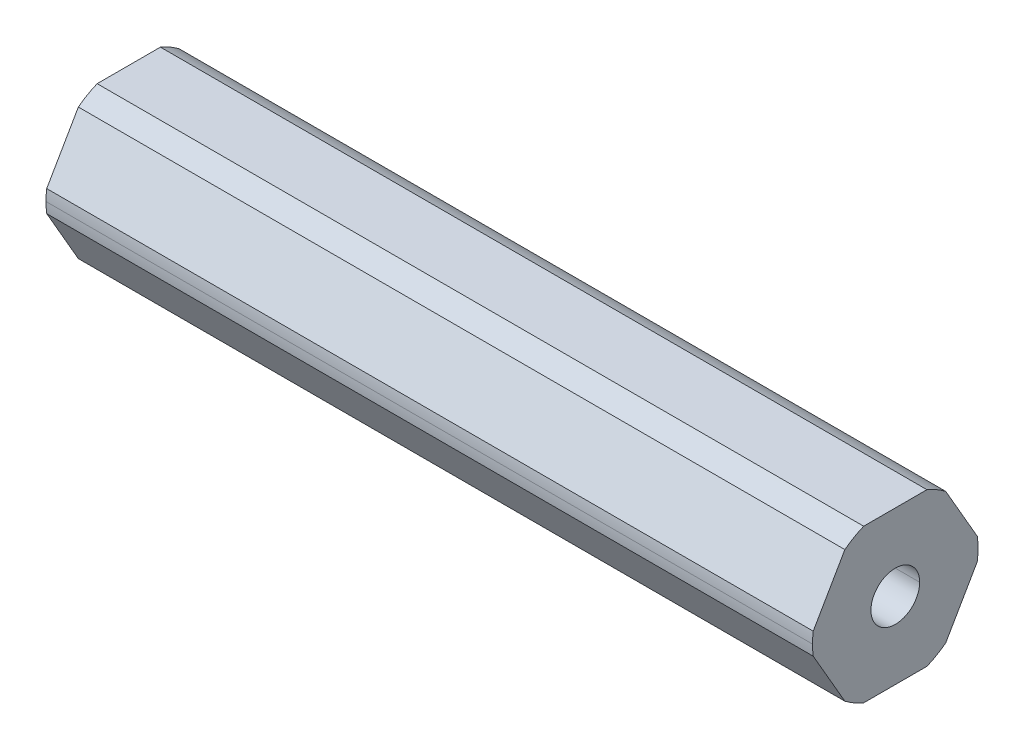
ISO-10303-21;
HEADER;
FILE_DESCRIPTION(('STEP AP214'),'2;1');
FILE_NAME('part.step','',(''),(''),'','','');
FILE_SCHEMA(('AUTOMOTIVE_DESIGN { 1 0 10303 214 1 1 1 1 }'));
ENDSEC;
DATA;
#1=APPLICATION_CONTEXT('core data for automotive mechanical design processes');
#2=APPLICATION_PROTOCOL_DEFINITION('international standard','automotive_design',2000,#1);
#3=PRODUCT_CONTEXT('',#1,'mechanical');
#4=PRODUCT('Part','Part','',(#3));
#5=PRODUCT_RELATED_PRODUCT_CATEGORY('part','',(#4));
#6=PRODUCT_DEFINITION_FORMATION('','',#4);
#7=PRODUCT_DEFINITION_CONTEXT('part definition',#1,'design');
#8=PRODUCT_DEFINITION('design','',#6,#7);
#9=PRODUCT_DEFINITION_SHAPE('','',#8);
#10=(LENGTH_UNIT() NAMED_UNIT(*) SI_UNIT(.MILLI.,.METRE.));
#11=(NAMED_UNIT(*) PLANE_ANGLE_UNIT() SI_UNIT($,.RADIAN.));
#12=(NAMED_UNIT(*) SI_UNIT($,.STERADIAN.) SOLID_ANGLE_UNIT());
#13=UNCERTAINTY_MEASURE_WITH_UNIT(LENGTH_MEASURE(1.E-05),#10,'distance_accuracy_value','');
#14=(GEOMETRIC_REPRESENTATION_CONTEXT(3) GLOBAL_UNCERTAINTY_ASSIGNED_CONTEXT((#13)) GLOBAL_UNIT_ASSIGNED_CONTEXT((#10,
#11,#12)) REPRESENTATION_CONTEXT('',''));
#15=CARTESIAN_POINT('',(0.,0.,0.));
#16=DIRECTION('',(0.,0.,1.));
#17=DIRECTION('',(1.,0.,0.));
#18=AXIS2_PLACEMENT_3D('',#15,#16,#17);
#19=CARTESIAN_POINT('',(31.75,0.,0.));
#20=DIRECTION('',(1.,0.,0.));
#21=DIRECTION('',(0.,0.,-1.));
#22=AXIS2_PLACEMENT_3D('',#19,#20,#21);
#23=CYLINDRICAL_SURFACE('',#22,2.0193);
#24=DIRECTION('',(1.,0.,0.));
#25=VECTOR('',#24,1.);
#26=CARTESIAN_POINT('',(31.75,0.,2.0193));
#27=LINE('',#26,#25);
#28=CARTESIAN_POINT('',(-31.75,0.,2.0193));
#29=VERTEX_POINT('',#28);
#30=CARTESIAN_POINT('',(31.75,0.,2.0193));
#31=VERTEX_POINT('',#30);
#32=EDGE_CURVE('E255',#29,#31,#27,.T.);
#33=ORIENTED_EDGE('',*,*,#32,.F.);
#34=CARTESIAN_POINT('',(-31.75,0.,0.));
#35=DIRECTION('',(-1.,0.,0.));
#36=DIRECTION('',(0.,0.,1.));
#37=AXIS2_PLACEMENT_3D('',#34,#35,#36);
#38=CIRCLE('',#37,2.0193);
#39=CARTESIAN_POINT('',(-31.75,0.,-2.0193));
#40=VERTEX_POINT('',#39);
#41=EDGE_CURVE('E11',#29,#40,#38,.T.);
#42=ORIENTED_EDGE('',*,*,#41,.T.);
#43=DIRECTION('',(1.,0.,0.));
#44=VECTOR('',#43,1.);
#45=CARTESIAN_POINT('',(31.75,0.,-2.0193));
#46=LINE('',#45,#44);
#47=CARTESIAN_POINT('',(31.75,0.,-2.0193));
#48=VERTEX_POINT('',#47);
#49=EDGE_CURVE('E167',#40,#48,#46,.T.);
#50=ORIENTED_EDGE('',*,*,#49,.T.);
#51=CARTESIAN_POINT('',(31.75,0.,0.));
#52=DIRECTION('',(1.,0.,0.));
#53=DIRECTION('',(0.,0.,-1.));
#54=AXIS2_PLACEMENT_3D('',#51,#52,#53);
#55=CIRCLE('',#54,2.0193);
#56=EDGE_CURVE('E27',#48,#31,#55,.T.);
#57=ORIENTED_EDGE('',*,*,#56,.T.);
#58=EDGE_LOOP('',(#33,#42,#50,#57));
#59=FACE_BOUND('',#58,.T.);
#60=ADVANCED_FACE('F16',(#59),#23,.F.);
#61=CARTESIAN_POINT('',(-31.75,0.,0.));
#62=DIRECTION('',(1.,0.,0.));
#63=DIRECTION('',(0.,1.,0.));
#64=AXIS2_PLACEMENT_3D('',#61,#62,#63);
#65=PLANE('',#64);
#66=CARTESIAN_POINT('',(-31.75,0.,0.));
#67=DIRECTION('',(-1.,0.,0.));
#68=DIRECTION('',(0.,0.,1.));
#69=AXIS2_PLACEMENT_3D('',#66,#67,#68);
#70=CIRCLE('',#69,2.0193);
#71=EDGE_CURVE('E252',#40,#29,#70,.T.);
#72=ORIENTED_EDGE('',*,*,#71,.F.);
#73=ORIENTED_EDGE('',*,*,#41,.F.);
#74=EDGE_LOOP('',(#72,#73));
#75=FACE_BOUND('',#74,.T.);
#76=DIRECTION('',(0.,0.866025403784439,0.5));
#77=VECTOR('',#76,1.);
#78=CARTESIAN_POINT('',(-31.75,3.16865,-5.48826279140312));
#79=LINE('',#78,#77);
#80=CARTESIAN_POINT('',(-31.75,0.898607151836118,-6.79887264086253));
#81=VERTEX_POINT('',#80);
#82=CARTESIAN_POINT('',(-31.75,5.43869284816389,-4.17765294194372));
#83=VERTEX_POINT('',#82);
#84=EDGE_CURVE('E158',#81,#83,#79,.T.);
#85=ORIENTED_EDGE('',*,*,#84,.F.);
#86=CARTESIAN_POINT('',(-31.75,0.,0.));
#87=DIRECTION('',(1.,0.,0.));
#88=DIRECTION('',(0.,0.,-1.));
#89=AXIS2_PLACEMENT_3D('',#86,#87,#88);
#90=CIRCLE('',#89,6.858);
#91=CARTESIAN_POINT('',(-31.75,-0.898607151836106,-6.79887264086253));
#92=VERTEX_POINT('',#91);
#93=EDGE_CURVE('E196',#92,#81,#90,.T.);
#94=ORIENTED_EDGE('',*,*,#93,.F.);
#95=DIRECTION('',(0.,0.866025403784439,-0.5));
#96=VECTOR('',#95,1.);
#97=CARTESIAN_POINT('',(-31.75,-3.16865,-5.48826279140312));
#98=LINE('',#97,#96);
#99=CARTESIAN_POINT('',(-31.75,-5.43869284816389,-4.17765294194372));
#100=VERTEX_POINT('',#99);
#101=EDGE_CURVE('E205',#100,#92,#98,.T.);
#102=ORIENTED_EDGE('',*,*,#101,.F.);
#103=CARTESIAN_POINT('',(-31.75,0.,0.));
#104=DIRECTION('',(1.,0.,0.));
#105=DIRECTION('',(0.,0.,-1.));
#106=AXIS2_PLACEMENT_3D('',#103,#104,#105);
#107=CIRCLE('',#106,6.858);
#108=CARTESIAN_POINT('',(-31.75,-6.3373,-2.62121969891881));
#109=VERTEX_POINT('',#108);
#110=EDGE_CURVE('E292',#109,#100,#107,.T.);
#111=ORIENTED_EDGE('',*,*,#110,.F.);
#112=DIRECTION('',(0.,0.,-1.));
#113=VECTOR('',#112,1.);
#114=CARTESIAN_POINT('',(-31.75,-6.3373,0.));
#115=LINE('',#114,#113);
#116=CARTESIAN_POINT('',(-31.75,-6.3373,2.62121969891881));
#117=VERTEX_POINT('',#116);
#118=EDGE_CURVE('E216',#117,#109,#115,.T.);
#119=ORIENTED_EDGE('',*,*,#118,.F.);
#120=CARTESIAN_POINT('',(-31.75,0.,0.));
#121=DIRECTION('',(1.,0.,0.));
#122=DIRECTION('',(0.,0.,-1.));
#123=AXIS2_PLACEMENT_3D('',#120,#121,#122);
#124=CIRCLE('',#123,6.858);
#125=CARTESIAN_POINT('',(-31.75,-5.43869284816389,4.17765294194372));
#126=VERTEX_POINT('',#125);
#127=EDGE_CURVE('E149',#126,#117,#124,.T.);
#128=ORIENTED_EDGE('',*,*,#127,.F.);
#129=DIRECTION('',(0.,-0.866025403784439,-0.5));
#130=VECTOR('',#129,1.);
#131=CARTESIAN_POINT('',(-31.75,-3.16865,5.48826279140312));
#132=LINE('',#131,#130);
#133=CARTESIAN_POINT('',(-31.75,-0.898607151836111,6.79887264086253));
#134=VERTEX_POINT('',#133);
#135=EDGE_CURVE('E193',#134,#126,#132,.T.);
#136=ORIENTED_EDGE('',*,*,#135,.F.);
#137=CARTESIAN_POINT('',(-31.75,0.,0.));
#138=DIRECTION('',(1.,0.,0.));
#139=DIRECTION('',(0.,0.,-1.));
#140=AXIS2_PLACEMENT_3D('',#137,#138,#139);
#141=CIRCLE('',#140,6.858);
#142=CARTESIAN_POINT('',(-31.75,0.,6.858));
#143=VERTEX_POINT('',#142);
#144=EDGE_CURVE('E156',#143,#134,#141,.T.);
#145=ORIENTED_EDGE('',*,*,#144,.F.);
#146=CARTESIAN_POINT('',(-31.75,0.,0.));
#147=DIRECTION('',(1.,0.,0.));
#148=DIRECTION('',(0.,0.,-1.));
#149=AXIS2_PLACEMENT_3D('',#146,#147,#148);
#150=CIRCLE('',#149,6.858);
#151=CARTESIAN_POINT('',(-31.75,0.898607151836102,6.79887264086253));
#152=VERTEX_POINT('',#151);
#153=EDGE_CURVE('E243',#152,#143,#150,.T.);
#154=ORIENTED_EDGE('',*,*,#153,.F.);
#155=DIRECTION('',(0.,-0.866025403784439,0.5));
#156=VECTOR('',#155,1.);
#157=CARTESIAN_POINT('',(-31.75,3.16865,5.48826279140312));
#158=LINE('',#157,#156);
#159=CARTESIAN_POINT('',(-31.75,5.43869284816389,4.17765294194372));
#160=VERTEX_POINT('',#159);
#161=EDGE_CURVE('E237',#160,#152,#158,.T.);
#162=ORIENTED_EDGE('',*,*,#161,.F.);
#163=CARTESIAN_POINT('',(-31.75,0.,0.));
#164=DIRECTION('',(1.,0.,0.));
#165=DIRECTION('',(0.,0.,-1.));
#166=AXIS2_PLACEMENT_3D('',#163,#164,#165);
#167=CIRCLE('',#166,6.858);
#168=CARTESIAN_POINT('',(-31.75,6.3373,2.62121969891881));
#169=VERTEX_POINT('',#168);
#170=EDGE_CURVE('E66',#169,#160,#167,.T.);
#171=ORIENTED_EDGE('',*,*,#170,.F.);
#172=DIRECTION('',(0.,0.,1.));
#173=VECTOR('',#172,1.);
#174=CARTESIAN_POINT('',(-31.75,6.3373,0.));
#175=LINE('',#174,#173);
#176=CARTESIAN_POINT('',(-31.75,6.3373,-2.62121969891881));
#177=VERTEX_POINT('',#176);
#178=EDGE_CURVE('E200',#177,#169,#175,.T.);
#179=ORIENTED_EDGE('',*,*,#178,.F.);
#180=CARTESIAN_POINT('',(-31.75,0.,0.));
#181=DIRECTION('',(1.,0.,0.));
#182=DIRECTION('',(0.,0.,-1.));
#183=AXIS2_PLACEMENT_3D('',#180,#181,#182);
#184=CIRCLE('',#183,6.858);
#185=EDGE_CURVE('E212',#83,#177,#184,.T.);
#186=ORIENTED_EDGE('',*,*,#185,.F.);
#187=EDGE_LOOP('',(#85,#94,#102,#111,#119,#128,#136,#145,#154,#162,#171,#179,#186));
#188=FACE_BOUND('',#187,.T.);
#189=ADVANCED_FACE('F266',(#75,#188),#65,.F.);
#190=CARTESIAN_POINT('',(31.75,0.,0.));
#191=DIRECTION('',(1.,0.,0.));
#192=DIRECTION('',(0.,1.,0.));
#193=AXIS2_PLACEMENT_3D('',#190,#191,#192);
#194=PLANE('',#193);
#195=ORIENTED_EDGE('',*,*,#56,.F.);
#196=CARTESIAN_POINT('',(31.75,0.,0.));
#197=DIRECTION('',(1.,0.,0.));
#198=DIRECTION('',(0.,0.,-1.));
#199=AXIS2_PLACEMENT_3D('',#196,#197,#198);
#200=CIRCLE('',#199,2.0193);
#201=EDGE_CURVE('E176',#31,#48,#200,.T.);
#202=ORIENTED_EDGE('',*,*,#201,.F.);
#203=EDGE_LOOP('',(#195,#202));
#204=FACE_BOUND('',#203,.T.);
#205=DIRECTION('',(0.,0.866025403784439,0.5));
#206=VECTOR('',#205,1.);
#207=CARTESIAN_POINT('',(31.75,3.16865,-5.48826279140312));
#208=LINE('',#207,#206);
#209=CARTESIAN_POINT('',(31.75,0.898607151836118,-6.79887264086253));
#210=VERTEX_POINT('',#209);
#211=CARTESIAN_POINT('',(31.75,5.43869284816389,-4.17765294194372));
#212=VERTEX_POINT('',#211);
#213=EDGE_CURVE('E186',#210,#212,#208,.T.);
#214=ORIENTED_EDGE('',*,*,#213,.T.);
#215=CARTESIAN_POINT('',(31.75,0.,0.));
#216=DIRECTION('',(1.,0.,0.));
#217=DIRECTION('',(0.,0.,-1.));
#218=AXIS2_PLACEMENT_3D('',#215,#216,#217);
#219=CIRCLE('',#218,6.858);
#220=CARTESIAN_POINT('',(31.75,6.3373,-2.62121969891881));
#221=VERTEX_POINT('',#220);
#222=EDGE_CURVE('E323',#212,#221,#219,.T.);
#223=ORIENTED_EDGE('',*,*,#222,.T.);
#224=DIRECTION('',(0.,0.,1.));
#225=VECTOR('',#224,1.);
#226=CARTESIAN_POINT('',(31.75,6.3373,0.));
#227=LINE('',#226,#225);
#228=CARTESIAN_POINT('',(31.75,6.3373,2.62121969891881));
#229=VERTEX_POINT('',#228);
#230=EDGE_CURVE('E20',#221,#229,#227,.T.);
#231=ORIENTED_EDGE('',*,*,#230,.T.);
#232=CARTESIAN_POINT('',(31.75,0.,0.));
#233=DIRECTION('',(1.,0.,0.));
#234=DIRECTION('',(0.,0.,-1.));
#235=AXIS2_PLACEMENT_3D('',#232,#233,#234);
#236=CIRCLE('',#235,6.858);
#237=CARTESIAN_POINT('',(31.75,5.43869284816389,4.17765294194372));
#238=VERTEX_POINT('',#237);
#239=EDGE_CURVE('E79',#229,#238,#236,.T.);
#240=ORIENTED_EDGE('',*,*,#239,.T.);
#241=DIRECTION('',(0.,-0.866025403784439,0.5));
#242=VECTOR('',#241,1.);
#243=CARTESIAN_POINT('',(31.75,3.16865,5.48826279140312));
#244=LINE('',#243,#242);
#245=CARTESIAN_POINT('',(31.75,0.898607151836102,6.79887264086253));
#246=VERTEX_POINT('',#245);
#247=EDGE_CURVE('E187',#238,#246,#244,.T.);
#248=ORIENTED_EDGE('',*,*,#247,.T.);
#249=CARTESIAN_POINT('',(31.75,0.,0.));
#250=DIRECTION('',(1.,0.,0.));
#251=DIRECTION('',(0.,0.,-1.));
#252=AXIS2_PLACEMENT_3D('',#249,#250,#251);
#253=CIRCLE('',#252,6.858);
#254=CARTESIAN_POINT('',(31.75,0.,6.858));
#255=VERTEX_POINT('',#254);
#256=EDGE_CURVE('E163',#246,#255,#253,.T.);
#257=ORIENTED_EDGE('',*,*,#256,.T.);
#258=CARTESIAN_POINT('',(31.75,0.,0.));
#259=DIRECTION('',(1.,0.,0.));
#260=DIRECTION('',(0.,0.,-1.));
#261=AXIS2_PLACEMENT_3D('',#258,#259,#260);
#262=CIRCLE('',#261,6.858);
#263=CARTESIAN_POINT('',(31.75,-0.898607151836111,6.79887264086253));
#264=VERTEX_POINT('',#263);
#265=EDGE_CURVE('E154',#255,#264,#262,.T.);
#266=ORIENTED_EDGE('',*,*,#265,.T.);
#267=DIRECTION('',(0.,-0.866025403784439,-0.5));
#268=VECTOR('',#267,1.);
#269=CARTESIAN_POINT('',(31.75,-3.16865,5.48826279140312));
#270=LINE('',#269,#268);
#271=CARTESIAN_POINT('',(31.75,-5.43869284816389,4.17765294194372));
#272=VERTEX_POINT('',#271);
#273=EDGE_CURVE('E137',#264,#272,#270,.T.);
#274=ORIENTED_EDGE('',*,*,#273,.T.);
#275=CARTESIAN_POINT('',(31.75,0.,0.));
#276=DIRECTION('',(1.,0.,0.));
#277=DIRECTION('',(0.,0.,-1.));
#278=AXIS2_PLACEMENT_3D('',#275,#276,#277);
#279=CIRCLE('',#278,6.858);
#280=CARTESIAN_POINT('',(31.75,-6.3373,2.62121969891881));
#281=VERTEX_POINT('',#280);
#282=EDGE_CURVE('E213',#272,#281,#279,.T.);
#283=ORIENTED_EDGE('',*,*,#282,.T.);
#284=DIRECTION('',(0.,0.,-1.));
#285=VECTOR('',#284,1.);
#286=CARTESIAN_POINT('',(31.75,-6.3373,0.));
#287=LINE('',#286,#285);
#288=CARTESIAN_POINT('',(31.75,-6.3373,-2.62121969891881));
#289=VERTEX_POINT('',#288);
#290=EDGE_CURVE('E286',#281,#289,#287,.T.);
#291=ORIENTED_EDGE('',*,*,#290,.T.);
#292=CARTESIAN_POINT('',(31.75,0.,0.));
#293=DIRECTION('',(1.,0.,0.));
#294=DIRECTION('',(0.,0.,-1.));
#295=AXIS2_PLACEMENT_3D('',#292,#293,#294);
#296=CIRCLE('',#295,6.858);
#297=CARTESIAN_POINT('',(31.75,-5.43869284816389,-4.17765294194372));
#298=VERTEX_POINT('',#297);
#299=EDGE_CURVE('E221',#289,#298,#296,.T.);
#300=ORIENTED_EDGE('',*,*,#299,.T.);
#301=DIRECTION('',(0.,0.866025403784439,-0.5));
#302=VECTOR('',#301,1.);
#303=CARTESIAN_POINT('',(31.75,-3.16865,-5.48826279140312));
#304=LINE('',#303,#302);
#305=CARTESIAN_POINT('',(31.75,-0.898607151836106,-6.79887264086253));
#306=VERTEX_POINT('',#305);
#307=EDGE_CURVE('E204',#298,#306,#304,.T.);
#308=ORIENTED_EDGE('',*,*,#307,.T.);
#309=CARTESIAN_POINT('',(31.75,0.,0.));
#310=DIRECTION('',(1.,0.,0.));
#311=DIRECTION('',(0.,0.,-1.));
#312=AXIS2_PLACEMENT_3D('',#309,#310,#311);
#313=CIRCLE('',#312,6.858);
#314=EDGE_CURVE('E42',#306,#210,#313,.T.);
#315=ORIENTED_EDGE('',*,*,#314,.T.);
#316=EDGE_LOOP('',(#214,#223,#231,#240,#248,#257,#266,#274,#283,#291,#300,#308,#315));
#317=FACE_BOUND('',#316,.T.);
#318=ADVANCED_FACE('F161',(#204,#317),#194,.T.);
#319=CARTESIAN_POINT('',(31.75,0.,0.));
#320=DIRECTION('',(-1.,0.,0.));
#321=DIRECTION('',(0.,0.,1.));
#322=AXIS2_PLACEMENT_3D('',#319,#320,#321);
#323=CYLINDRICAL_SURFACE('',#322,6.858);
#324=ORIENTED_EDGE('',*,*,#93,.T.);
#325=DIRECTION('',(-1.,0.,0.));
#326=VECTOR('',#325,1.);
#327=CARTESIAN_POINT('',(31.75,0.898607151836118,-6.79887264086253));
#328=LINE('',#327,#326);
#329=EDGE_CURVE('E208',#210,#81,#328,.T.);
#330=ORIENTED_EDGE('',*,*,#329,.F.);
#331=ORIENTED_EDGE('',*,*,#314,.F.);
#332=DIRECTION('',(-1.,0.,0.));
#333=VECTOR('',#332,1.);
#334=CARTESIAN_POINT('',(31.75,-0.898607151836106,-6.79887264086253));
#335=LINE('',#334,#333);
#336=EDGE_CURVE('E201',#306,#92,#335,.T.);
#337=ORIENTED_EDGE('',*,*,#336,.T.);
#338=EDGE_LOOP('',(#324,#330,#331,#337));
#339=FACE_BOUND('',#338,.T.);
#340=ADVANCED_FACE('F506',(#339),#323,.T.);
#341=CARTESIAN_POINT('',(31.75,-3.16865,-5.48826279140312));
#342=DIRECTION('',(0.,0.5,0.866025403784439));
#343=DIRECTION('',(1.,0.,0.));
#344=AXIS2_PLACEMENT_3D('',#341,#342,#343);
#345=PLANE('',#344);
#346=ORIENTED_EDGE('',*,*,#101,.T.);
#347=ORIENTED_EDGE('',*,*,#336,.F.);
#348=ORIENTED_EDGE('',*,*,#307,.F.);
#349=DIRECTION('',(-1.,0.,0.));
#350=VECTOR('',#349,1.);
#351=CARTESIAN_POINT('',(31.75,-5.43869284816389,-4.17765294194372));
#352=LINE('',#351,#350);
#353=EDGE_CURVE('E288',#298,#100,#352,.T.);
#354=ORIENTED_EDGE('',*,*,#353,.T.);
#355=EDGE_LOOP('',(#346,#347,#348,#354));
#356=FACE_BOUND('',#355,.T.);
#357=ADVANCED_FACE('F468',(#356),#345,.F.);
#358=CARTESIAN_POINT('',(31.75,0.,0.));
#359=DIRECTION('',(-1.,0.,0.));
#360=DIRECTION('',(0.,0.,1.));
#361=AXIS2_PLACEMENT_3D('',#358,#359,#360);
#362=CYLINDRICAL_SURFACE('',#361,6.858);
#363=ORIENTED_EDGE('',*,*,#110,.T.);
#364=ORIENTED_EDGE('',*,*,#353,.F.);
#365=ORIENTED_EDGE('',*,*,#299,.F.);
#366=DIRECTION('',(-1.,0.,0.));
#367=VECTOR('',#366,1.);
#368=CARTESIAN_POINT('',(31.75,-6.3373,-2.62121969891881));
#369=LINE('',#368,#367);
#370=EDGE_CURVE('E283',#289,#109,#369,.T.);
#371=ORIENTED_EDGE('',*,*,#370,.T.);
#372=EDGE_LOOP('',(#363,#364,#365,#371));
#373=FACE_BOUND('',#372,.T.);
#374=ADVANCED_FACE('F309',(#373),#362,.T.);
#375=CARTESIAN_POINT('',(31.75,-6.3373,0.));
#376=DIRECTION('',(0.,1.,0.));
#377=DIRECTION('',(0.,0.,-1.));
#378=AXIS2_PLACEMENT_3D('',#375,#376,#377);
#379=PLANE('',#378);
#380=ORIENTED_EDGE('',*,*,#118,.T.);
#381=ORIENTED_EDGE('',*,*,#370,.F.);
#382=ORIENTED_EDGE('',*,*,#290,.F.);
#383=DIRECTION('',(-1.,0.,0.));
#384=VECTOR('',#383,1.);
#385=CARTESIAN_POINT('',(31.75,-6.3373,2.62121969891881));
#386=LINE('',#385,#384);
#387=EDGE_CURVE('E217',#281,#117,#386,.T.);
#388=ORIENTED_EDGE('',*,*,#387,.T.);
#389=EDGE_LOOP('',(#380,#381,#382,#388));
#390=FACE_BOUND('',#389,.T.);
#391=ADVANCED_FACE('F301',(#390),#379,.F.);
#392=CARTESIAN_POINT('',(31.75,0.,0.));
#393=DIRECTION('',(-1.,0.,0.));
#394=DIRECTION('',(0.,0.,1.));
#395=AXIS2_PLACEMENT_3D('',#392,#393,#394);
#396=CYLINDRICAL_SURFACE('',#395,6.858);
#397=ORIENTED_EDGE('',*,*,#127,.T.);
#398=ORIENTED_EDGE('',*,*,#387,.F.);
#399=ORIENTED_EDGE('',*,*,#282,.F.);
#400=DIRECTION('',(-1.,0.,0.));
#401=VECTOR('',#400,1.);
#402=CARTESIAN_POINT('',(31.75,-5.43869284816389,4.17765294194372));
#403=LINE('',#402,#401);
#404=EDGE_CURVE('E144',#272,#126,#403,.T.);
#405=ORIENTED_EDGE('',*,*,#404,.T.);
#406=EDGE_LOOP('',(#397,#398,#399,#405));
#407=FACE_BOUND('',#406,.T.);
#408=ADVANCED_FACE('F485',(#407),#396,.T.);
#409=CARTESIAN_POINT('',(31.75,-3.16865,5.48826279140312));
#410=DIRECTION('',(0.,0.5,-0.866025403784439));
#411=DIRECTION('',(-1.,0.,0.));
#412=AXIS2_PLACEMENT_3D('',#409,#410,#411);
#413=PLANE('',#412);
#414=ORIENTED_EDGE('',*,*,#135,.T.);
#415=ORIENTED_EDGE('',*,*,#404,.F.);
#416=ORIENTED_EDGE('',*,*,#273,.F.);
#417=DIRECTION('',(-1.,0.,0.));
#418=VECTOR('',#417,1.);
#419=CARTESIAN_POINT('',(31.75,-0.898607151836111,6.79887264086253));
#420=LINE('',#419,#418);
#421=EDGE_CURVE('E141',#264,#134,#420,.T.);
#422=ORIENTED_EDGE('',*,*,#421,.T.);
#423=EDGE_LOOP('',(#414,#415,#416,#422));
#424=FACE_BOUND('',#423,.T.);
#425=ADVANCED_FACE('F140',(#424),#413,.F.);
#426=CARTESIAN_POINT('',(31.75,0.,0.));
#427=DIRECTION('',(-1.,0.,0.));
#428=DIRECTION('',(0.,0.,1.));
#429=AXIS2_PLACEMENT_3D('',#426,#427,#428);
#430=CYLINDRICAL_SURFACE('',#429,6.858);
#431=DIRECTION('',(-1.,0.,0.));
#432=VECTOR('',#431,1.);
#433=CARTESIAN_POINT('',(31.75,0.,6.858));
#434=LINE('',#433,#432);
#435=EDGE_CURVE('E166',#255,#143,#434,.T.);
#436=ORIENTED_EDGE('',*,*,#435,.F.);
#437=ORIENTED_EDGE('',*,*,#256,.F.);
#438=DIRECTION('',(-1.,0.,0.));
#439=VECTOR('',#438,1.);
#440=CARTESIAN_POINT('',(31.75,0.898607151836102,6.79887264086253));
#441=LINE('',#440,#439);
#442=EDGE_CURVE('E190',#246,#152,#441,.T.);
#443=ORIENTED_EDGE('',*,*,#442,.T.);
#444=ORIENTED_EDGE('',*,*,#153,.T.);
#445=EDGE_LOOP('',(#436,#437,#443,#444));
#446=FACE_BOUND('',#445,.T.);
#447=ADVANCED_FACE('F262',(#446),#430,.T.);
#448=CARTESIAN_POINT('',(31.75,3.16865,5.48826279140312));
#449=DIRECTION('',(0.,-0.5,-0.866025403784439));
#450=DIRECTION('',(0.,-0.866025403784439,0.5));
#451=AXIS2_PLACEMENT_3D('',#448,#449,#450);
#452=PLANE('',#451);
#453=ORIENTED_EDGE('',*,*,#161,.T.);
#454=ORIENTED_EDGE('',*,*,#442,.F.);
#455=ORIENTED_EDGE('',*,*,#247,.F.);
#456=DIRECTION('',(-1.,0.,0.));
#457=VECTOR('',#456,1.);
#458=CARTESIAN_POINT('',(31.75,5.43869284816389,4.17765294194372));
#459=LINE('',#458,#457);
#460=EDGE_CURVE('E228',#238,#160,#459,.T.);
#461=ORIENTED_EDGE('',*,*,#460,.T.);
#462=EDGE_LOOP('',(#453,#454,#455,#461));
#463=FACE_BOUND('',#462,.T.);
#464=ADVANCED_FACE('F264',(#463),#452,.F.);
#465=CARTESIAN_POINT('',(31.75,0.,0.));
#466=DIRECTION('',(-1.,0.,0.));
#467=DIRECTION('',(0.,0.,1.));
#468=AXIS2_PLACEMENT_3D('',#465,#466,#467);
#469=CYLINDRICAL_SURFACE('',#468,6.858);
#470=ORIENTED_EDGE('',*,*,#170,.T.);
#471=ORIENTED_EDGE('',*,*,#460,.F.);
#472=ORIENTED_EDGE('',*,*,#239,.F.);
#473=DIRECTION('',(-1.,0.,0.));
#474=VECTOR('',#473,1.);
#475=CARTESIAN_POINT('',(31.75,6.3373,2.62121969891881));
#476=LINE('',#475,#474);
#477=EDGE_CURVE('E197',#229,#169,#476,.T.);
#478=ORIENTED_EDGE('',*,*,#477,.T.);
#479=EDGE_LOOP('',(#470,#471,#472,#478));
#480=FACE_BOUND('',#479,.T.);
#481=ADVANCED_FACE('F425',(#480),#469,.T.);
#482=CARTESIAN_POINT('',(31.75,6.3373,0.));
#483=DIRECTION('',(0.,-1.,0.));
#484=DIRECTION('',(0.,0.,-1.));
#485=AXIS2_PLACEMENT_3D('',#482,#483,#484);
#486=PLANE('',#485);
#487=ORIENTED_EDGE('',*,*,#178,.T.);
#488=ORIENTED_EDGE('',*,*,#477,.F.);
#489=ORIENTED_EDGE('',*,*,#230,.F.);
#490=DIRECTION('',(-1.,0.,0.));
#491=VECTOR('',#490,1.);
#492=CARTESIAN_POINT('',(31.75,6.3373,-2.62121969891881));
#493=LINE('',#492,#491);
#494=EDGE_CURVE('E180',#221,#177,#493,.T.);
#495=ORIENTED_EDGE('',*,*,#494,.T.);
#496=EDGE_LOOP('',(#487,#488,#489,#495));
#497=FACE_BOUND('',#496,.T.);
#498=ADVANCED_FACE('F430',(#497),#486,.F.);
#499=CARTESIAN_POINT('',(31.75,0.,0.));
#500=DIRECTION('',(-1.,0.,0.));
#501=DIRECTION('',(0.,0.,1.));
#502=AXIS2_PLACEMENT_3D('',#499,#500,#501);
#503=CYLINDRICAL_SURFACE('',#502,6.858);
#504=ORIENTED_EDGE('',*,*,#185,.T.);
#505=ORIENTED_EDGE('',*,*,#494,.F.);
#506=ORIENTED_EDGE('',*,*,#222,.F.);
#507=DIRECTION('',(-1.,0.,0.));
#508=VECTOR('',#507,1.);
#509=CARTESIAN_POINT('',(31.75,5.43869284816389,-4.17765294194372));
#510=LINE('',#509,#508);
#511=EDGE_CURVE('E182',#212,#83,#510,.T.);
#512=ORIENTED_EDGE('',*,*,#511,.T.);
#513=EDGE_LOOP('',(#504,#505,#506,#512));
#514=FACE_BOUND('',#513,.T.);
#515=ADVANCED_FACE('F416',(#514),#503,.T.);
#516=CARTESIAN_POINT('',(31.75,3.16865,-5.48826279140312));
#517=DIRECTION('',(0.,-0.5,0.866025403784439));
#518=DIRECTION('',(-1.,0.,0.));
#519=AXIS2_PLACEMENT_3D('',#516,#517,#518);
#520=PLANE('',#519);
#521=ORIENTED_EDGE('',*,*,#84,.T.);
#522=ORIENTED_EDGE('',*,*,#511,.F.);
#523=ORIENTED_EDGE('',*,*,#213,.F.);
#524=ORIENTED_EDGE('',*,*,#329,.T.);
#525=EDGE_LOOP('',(#521,#522,#523,#524));
#526=FACE_BOUND('',#525,.T.);
#527=ADVANCED_FACE('F411',(#526),#520,.F.);
#528=CARTESIAN_POINT('',(31.75,0.,0.));
#529=DIRECTION('',(-1.,0.,0.));
#530=DIRECTION('',(0.,0.,1.));
#531=AXIS2_PLACEMENT_3D('',#528,#529,#530);
#532=CYLINDRICAL_SURFACE('',#531,6.858);
#533=ORIENTED_EDGE('',*,*,#265,.F.);
#534=ORIENTED_EDGE('',*,*,#435,.T.);
#535=ORIENTED_EDGE('',*,*,#144,.T.);
#536=ORIENTED_EDGE('',*,*,#421,.F.);
#537=EDGE_LOOP('',(#533,#534,#535,#536));
#538=FACE_BOUND('',#537,.T.);
#539=ADVANCED_FACE('F18',(#538),#532,.T.);
#540=CARTESIAN_POINT('',(31.75,0.,0.));
#541=DIRECTION('',(1.,0.,0.));
#542=DIRECTION('',(0.,0.,-1.));
#543=AXIS2_PLACEMENT_3D('',#540,#541,#542);
#544=CYLINDRICAL_SURFACE('',#543,2.0193);
#545=ORIENTED_EDGE('',*,*,#71,.T.);
#546=ORIENTED_EDGE('',*,*,#32,.T.);
#547=ORIENTED_EDGE('',*,*,#201,.T.);
#548=ORIENTED_EDGE('',*,*,#49,.F.);
#549=EDGE_LOOP('',(#545,#546,#547,#548));
#550=FACE_BOUND('',#549,.T.);
#551=ADVANCED_FACE('F451',(#550),#544,.F.);
#552=CLOSED_SHELL('',(#60,#189,#318,#340,#357,#374,#391,#408,#425,#447,#464,#481,#498,#515,#527,
#539,#551));
#553=MANIFOLD_SOLID_BREP('B1',#552);
#554=ADVANCED_BREP_SHAPE_REPRESENTATION('',(#18,#553),#14);
#555=SHAPE_DEFINITION_REPRESENTATION(#9,#554);
ENDSEC;
END-ISO-10303-21;
